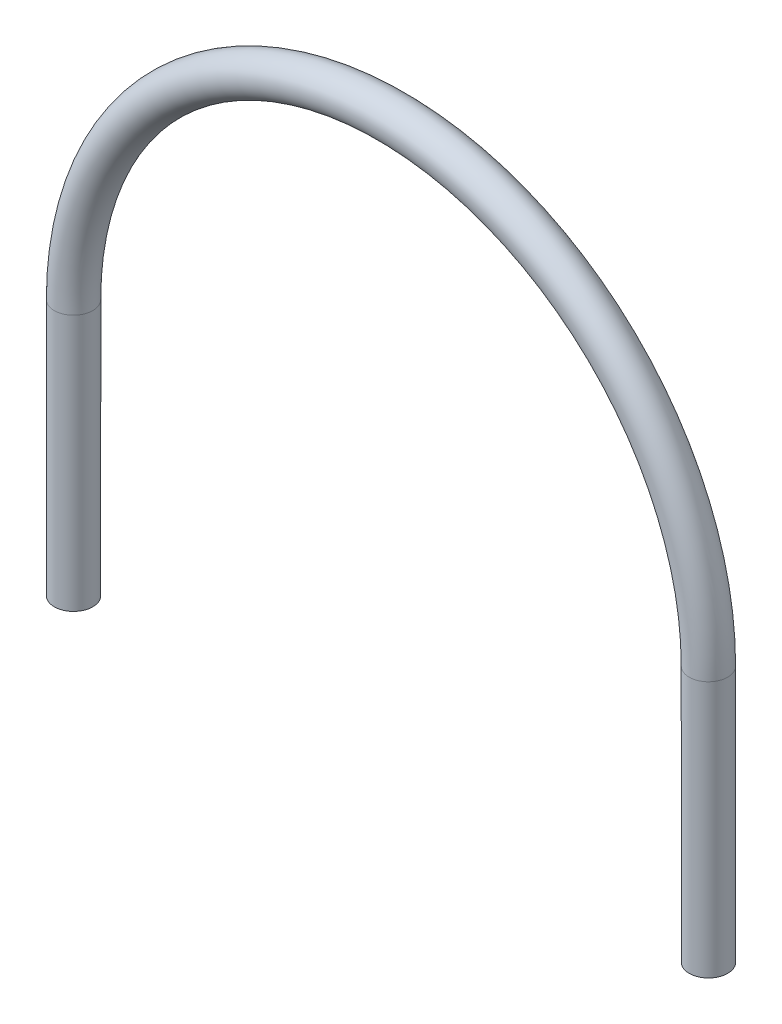
ISO-10303-21;
HEADER;
FILE_DESCRIPTION(('STEP AP214'),'2;1');
FILE_NAME('part.step','',(''),(''),'','','');
FILE_SCHEMA(('AUTOMOTIVE_DESIGN { 1 0 10303 214 1 1 1 1 }'));
ENDSEC;
DATA;
#1=APPLICATION_CONTEXT('core data for automotive mechanical design processes');
#2=APPLICATION_PROTOCOL_DEFINITION('international standard','automotive_design',2000,#1);
#3=PRODUCT_CONTEXT('',#1,'mechanical');
#4=PRODUCT('Part','Part','',(#3));
#5=PRODUCT_RELATED_PRODUCT_CATEGORY('part','',(#4));
#6=PRODUCT_DEFINITION_FORMATION('','',#4);
#7=PRODUCT_DEFINITION_CONTEXT('part definition',#1,'design');
#8=PRODUCT_DEFINITION('design','',#6,#7);
#9=PRODUCT_DEFINITION_SHAPE('','',#8);
#10=(LENGTH_UNIT() NAMED_UNIT(*) SI_UNIT(.MILLI.,.METRE.));
#11=(NAMED_UNIT(*) PLANE_ANGLE_UNIT() SI_UNIT($,.RADIAN.));
#12=(NAMED_UNIT(*) SI_UNIT($,.STERADIAN.) SOLID_ANGLE_UNIT());
#13=UNCERTAINTY_MEASURE_WITH_UNIT(LENGTH_MEASURE(1.E-05),#10,'distance_accuracy_value','');
#14=(GEOMETRIC_REPRESENTATION_CONTEXT(3) GLOBAL_UNCERTAINTY_ASSIGNED_CONTEXT((#13)) GLOBAL_UNIT_ASSIGNED_CONTEXT((#10,
#11,#12)) REPRESENTATION_CONTEXT('',''));
#15=CARTESIAN_POINT('',(0.,0.,0.));
#16=DIRECTION('',(0.,0.,1.));
#17=DIRECTION('',(1.,0.,0.));
#18=AXIS2_PLACEMENT_3D('',#15,#16,#17);
#19=CARTESIAN_POINT('',(-476.383795025688,-400.,0.));
#20=DIRECTION('',(0.,-1.,0.));
#21=DIRECTION('',(0.,0.,1.));
#22=AXIS2_PLACEMENT_3D('',#19,#20,#21);
#23=PLANE('',#22);
#24=CARTESIAN_POINT('',(-476.383795025688,-400.,0.));
#25=DIRECTION('',(0.,-1.,0.));
#26=DIRECTION('',(0.,0.,-1.));
#27=AXIS2_PLACEMENT_3D('',#24,#25,#26);
#28=CIRCLE('',#27,27.);
#29=CARTESIAN_POINT('',(-476.383795025688,-400.,-27.));
#30=VERTEX_POINT('',#29);
#31=EDGE_CURVE('E70',#30,#30,#28,.T.);
#32=ORIENTED_EDGE('',*,*,#31,.F.);
#33=EDGE_LOOP('',(#32));
#34=FACE_BOUND('',#33,.T.);
#35=CARTESIAN_POINT('',(-476.383795025688,-400.,0.));
#36=DIRECTION('',(0.,-1.,0.));
#37=DIRECTION('',(0.,0.,1.));
#38=AXIS2_PLACEMENT_3D('',#35,#36,#37);
#39=CIRCLE('',#38,30.);
#40=CARTESIAN_POINT('',(-476.383795025688,-400.,30.));
#41=VERTEX_POINT('',#40);
#42=EDGE_CURVE('E61',#41,#41,#39,.T.);
#43=ORIENTED_EDGE('',*,*,#42,.T.);
#44=EDGE_LOOP('',(#43));
#45=FACE_BOUND('',#44,.T.);
#46=ADVANCED_FACE('F47',(#34,#45),#23,.T.);
#47=CARTESIAN_POINT('',(513.616204974312,-400.,0.));
#48=DIRECTION('',(0.,1.,0.));
#49=DIRECTION('',(0.,0.,1.));
#50=AXIS2_PLACEMENT_3D('',#47,#48,#49);
#51=PLANE('',#50);
#52=CARTESIAN_POINT('',(513.616204974312,-400.,0.));
#53=DIRECTION('',(0.,1.,0.));
#54=DIRECTION('',(0.,0.,1.));
#55=AXIS2_PLACEMENT_3D('',#52,#53,#54);
#56=CIRCLE('',#55,27.);
#57=CARTESIAN_POINT('',(513.616204974312,-400.,27.));
#58=VERTEX_POINT('',#57);
#59=EDGE_CURVE('E66',#58,#58,#56,.T.);
#60=ORIENTED_EDGE('',*,*,#59,.T.);
#61=EDGE_LOOP('',(#60));
#62=FACE_BOUND('',#61,.T.);
#63=CARTESIAN_POINT('',(513.616204974312,-400.,0.));
#64=DIRECTION('',(0.,1.,0.));
#65=DIRECTION('',(0.,0.,1.));
#66=AXIS2_PLACEMENT_3D('',#63,#64,#65);
#67=CIRCLE('',#66,30.);
#68=CARTESIAN_POINT('',(513.616204974312,-400.,30.));
#69=VERTEX_POINT('',#68);
#70=EDGE_CURVE('E11',#69,#69,#67,.T.);
#71=ORIENTED_EDGE('',*,*,#70,.F.);
#72=EDGE_LOOP('',(#71));
#73=FACE_BOUND('',#72,.T.);
#74=ADVANCED_FACE('F90',(#62,#73),#51,.F.);
#75=CARTESIAN_POINT('',(-476.383795025688,-400.,0.));
#76=DIRECTION('',(0.,1.,0.));
#77=DIRECTION('',(0.,0.,1.));
#78=AXIS2_PLACEMENT_3D('',#75,#76,#77);
#79=CYLINDRICAL_SURFACE('',#78,30.);
#80=CARTESIAN_POINT('',(-476.383795025688,0.,0.));
#81=DIRECTION('',(0.,-1.,0.));
#82=DIRECTION('',(0.,0.,1.));
#83=AXIS2_PLACEMENT_3D('',#80,#81,#82);
#84=CIRCLE('',#83,30.);
#85=CARTESIAN_POINT('',(-506.383795025688,0.,0.));
#86=VERTEX_POINT('',#85);
#87=EDGE_CURVE('E57',#86,#86,#84,.T.);
#88=ORIENTED_EDGE('',*,*,#87,.T.);
#89=EDGE_LOOP('',(#88));
#90=FACE_BOUND('',#89,.T.);
#91=ORIENTED_EDGE('',*,*,#42,.F.);
#92=EDGE_LOOP('',(#91));
#93=FACE_BOUND('',#92,.T.);
#94=ADVANCED_FACE('F94',(#90,#93),#79,.T.);
#95=CARTESIAN_POINT('',(18.6162049743119,0.,0.));
#96=DIRECTION('',(0.,0.,-1.));
#97=DIRECTION('',(-1.,0.,0.));
#98=AXIS2_PLACEMENT_3D('',#95,#96,#97);
#99=TOROIDAL_SURFACE('',#98,495.,30.);
#100=CARTESIAN_POINT('',(513.616204974312,0.,0.));
#101=DIRECTION('',(0.,1.,0.));
#102=DIRECTION('',(0.,0.,1.));
#103=AXIS2_PLACEMENT_3D('',#100,#101,#102);
#104=CIRCLE('',#103,30.);
#105=CARTESIAN_POINT('',(543.616204974312,0.,0.));
#106=VERTEX_POINT('',#105);
#107=EDGE_CURVE('E53',#106,#106,#104,.T.);
#108=CARTESIAN_POINT('',(18.6162049743119,0.,0.));
#109=DIRECTION('',(0.,0.,-1.));
#110=DIRECTION('',(-1.,0.,0.));
#111=AXIS2_PLACEMENT_3D('',#108,#109,#110);
#112=CIRCLE('',#111,525.);
#113=EDGE_CURVE('',#86,#106,#112,.T.);
#114=ORIENTED_EDGE('',*,*,#87,.F.);
#115=ORIENTED_EDGE('',*,*,#107,.T.);
#116=ORIENTED_EDGE('',*,*,#113,.T.);
#117=ORIENTED_EDGE('',*,*,#113,.F.);
#118=EDGE_LOOP('',(#114,#116,#115,#117));
#119=FACE_BOUND('',#118,.T.);
#120=ADVANCED_FACE('F96',(#119),#99,.T.);
#121=CARTESIAN_POINT('',(513.616204974312,0.,0.));
#122=DIRECTION('',(0.,-1.,0.));
#123=DIRECTION('',(0.,0.,-1.));
#124=AXIS2_PLACEMENT_3D('',#121,#122,#123);
#125=CYLINDRICAL_SURFACE('',#124,30.);
#126=ORIENTED_EDGE('',*,*,#70,.T.);
#127=EDGE_LOOP('',(#126));
#128=FACE_BOUND('',#127,.T.);
#129=ORIENTED_EDGE('',*,*,#107,.F.);
#130=EDGE_LOOP('',(#129));
#131=FACE_BOUND('',#130,.T.);
#132=ADVANCED_FACE('F84',(#128,#131),#125,.T.);
#133=CARTESIAN_POINT('',(-476.383795025688,-400.,0.));
#134=DIRECTION('',(0.,1.,0.));
#135=DIRECTION('',(0.,0.,1.));
#136=AXIS2_PLACEMENT_3D('',#133,#134,#135);
#137=CYLINDRICAL_SURFACE('',#136,27.);
#138=CARTESIAN_POINT('',(-476.383795025688,0.,0.));
#139=DIRECTION('',(0.,1.,0.));
#140=DIRECTION('',(0.,0.,1.));
#141=AXIS2_PLACEMENT_3D('',#138,#139,#140);
#142=CIRCLE('',#141,27.);
#143=CARTESIAN_POINT('',(-503.383795025688,0.,0.));
#144=VERTEX_POINT('',#143);
#145=EDGE_CURVE('E73',#144,#144,#142,.F.);
#146=ORIENTED_EDGE('',*,*,#145,.F.);
#147=EDGE_LOOP('',(#146));
#148=FACE_BOUND('',#147,.T.);
#149=ORIENTED_EDGE('',*,*,#31,.T.);
#150=EDGE_LOOP('',(#149));
#151=FACE_BOUND('',#150,.T.);
#152=ADVANCED_FACE('F81',(#148,#151),#137,.F.);
#153=CARTESIAN_POINT('',(18.6162049743119,0.,0.));
#154=DIRECTION('',(0.,0.,-1.));
#155=DIRECTION('',(-1.,0.,0.));
#156=AXIS2_PLACEMENT_3D('',#153,#154,#155);
#157=TOROIDAL_SURFACE('',#156,495.,27.);
#158=CARTESIAN_POINT('',(513.616204974312,0.,0.));
#159=DIRECTION('',(0.,1.,0.));
#160=DIRECTION('',(-1.,0.,0.));
#161=AXIS2_PLACEMENT_3D('',#158,#159,#160);
#162=CIRCLE('',#161,27.);
#163=CARTESIAN_POINT('',(540.616204974312,0.,0.));
#164=VERTEX_POINT('',#163);
#165=EDGE_CURVE('E69',#164,#164,#162,.T.);
#166=CARTESIAN_POINT('',(18.6162049743119,0.,0.));
#167=DIRECTION('',(0.,0.,-1.));
#168=DIRECTION('',(-1.,0.,0.));
#169=AXIS2_PLACEMENT_3D('',#166,#167,#168);
#170=CIRCLE('',#169,522.);
#171=EDGE_CURVE('',#144,#164,#170,.T.);
#172=ORIENTED_EDGE('',*,*,#145,.T.);
#173=ORIENTED_EDGE('',*,*,#165,.F.);
#174=ORIENTED_EDGE('',*,*,#171,.T.);
#175=ORIENTED_EDGE('',*,*,#171,.F.);
#176=EDGE_LOOP('',(#172,#174,#173,#175));
#177=FACE_BOUND('',#176,.T.);
#178=ADVANCED_FACE('F79',(#177),#157,.F.);
#179=CARTESIAN_POINT('',(513.616204974312,0.,0.));
#180=DIRECTION('',(0.,-1.,0.));
#181=DIRECTION('',(0.,0.,-1.));
#182=AXIS2_PLACEMENT_3D('',#179,#180,#181);
#183=CYLINDRICAL_SURFACE('',#182,27.);
#184=ORIENTED_EDGE('',*,*,#59,.F.);
#185=EDGE_LOOP('',(#184));
#186=FACE_BOUND('',#185,.T.);
#187=ORIENTED_EDGE('',*,*,#165,.T.);
#188=EDGE_LOOP('',(#187));
#189=FACE_BOUND('',#188,.T.);
#190=ADVANCED_FACE('F91',(#186,#189),#183,.F.);
#191=CLOSED_SHELL('',(#46,#74,#94,#120,#132,#152,#178,#190));
#192=MANIFOLD_SOLID_BREP('B2',#191);
#193=ADVANCED_BREP_SHAPE_REPRESENTATION('',(#18,#192),#14);
#194=SHAPE_DEFINITION_REPRESENTATION(#9,#193);
ENDSEC;
END-ISO-10303-21;
